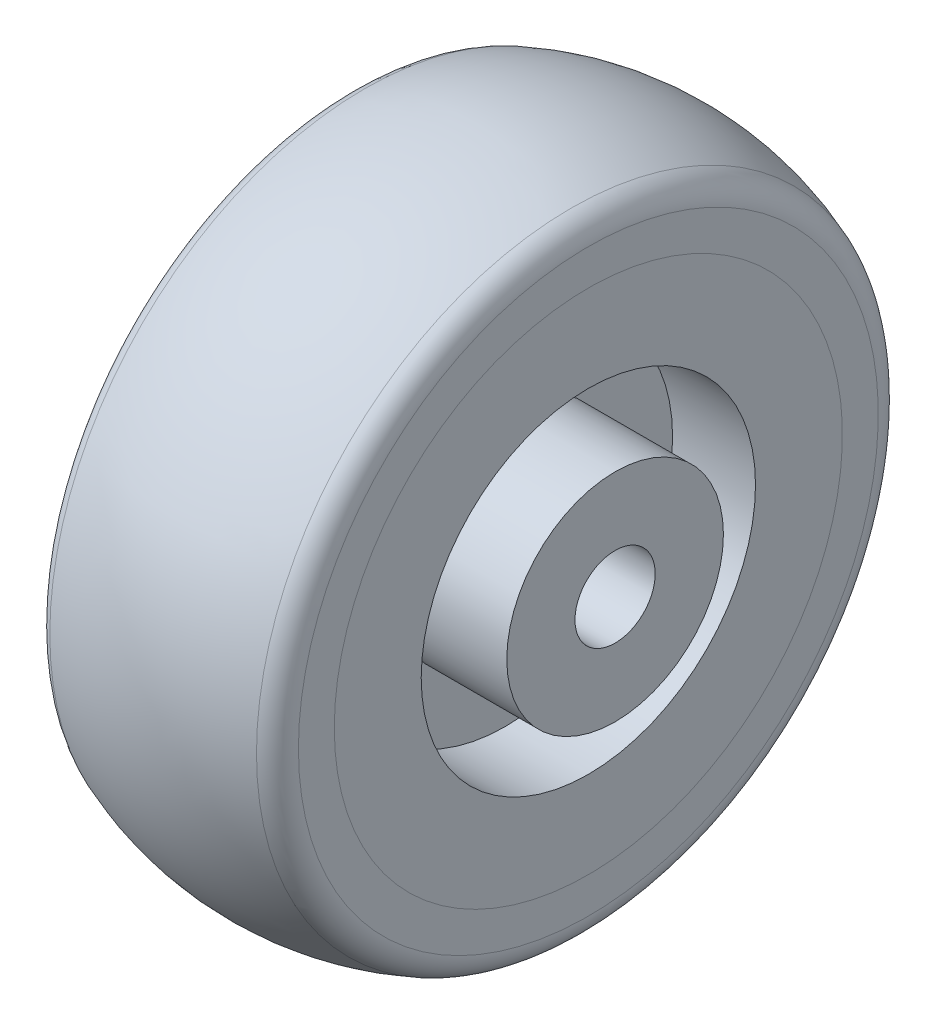
ISO-10303-21;
HEADER;
FILE_DESCRIPTION(('STEP AP214'),'2;1');
FILE_NAME('part.step','',(''),(''),'','','');
FILE_SCHEMA(('AUTOMOTIVE_DESIGN { 1 0 10303 214 1 1 1 1 }'));
ENDSEC;
DATA;
#1=APPLICATION_CONTEXT('core data for automotive mechanical design processes');
#2=APPLICATION_PROTOCOL_DEFINITION('international standard','automotive_design',2000,#1);
#3=PRODUCT_CONTEXT('',#1,'mechanical');
#4=PRODUCT('Part','Part','',(#3));
#5=PRODUCT_RELATED_PRODUCT_CATEGORY('part','',(#4));
#6=PRODUCT_DEFINITION_FORMATION('','',#4);
#7=PRODUCT_DEFINITION_CONTEXT('part definition',#1,'design');
#8=PRODUCT_DEFINITION('design','',#6,#7);
#9=PRODUCT_DEFINITION_SHAPE('','',#8);
#10=(LENGTH_UNIT() NAMED_UNIT(*) SI_UNIT(.MILLI.,.METRE.));
#11=(NAMED_UNIT(*) PLANE_ANGLE_UNIT() SI_UNIT($,.RADIAN.));
#12=(NAMED_UNIT(*) SI_UNIT($,.STERADIAN.) SOLID_ANGLE_UNIT());
#13=UNCERTAINTY_MEASURE_WITH_UNIT(LENGTH_MEASURE(1.E-05),#10,'distance_accuracy_value','');
#14=(GEOMETRIC_REPRESENTATION_CONTEXT(3) GLOBAL_UNCERTAINTY_ASSIGNED_CONTEXT((#13)) GLOBAL_UNIT_ASSIGNED_CONTEXT((#10,
#11,#12)) REPRESENTATION_CONTEXT('',''));
#15=CARTESIAN_POINT('',(0.,0.,0.));
#16=DIRECTION('',(0.,0.,1.));
#17=DIRECTION('',(1.,0.,0.));
#18=AXIS2_PLACEMENT_3D('',#15,#16,#17);
#19=CARTESIAN_POINT('',(-9.,12.5,0.));
#20=DIRECTION('',(1.,0.,0.));
#21=DIRECTION('',(0.,0.,-1.));
#22=AXIS2_PLACEMENT_3D('',#19,#20,#21);
#23=PLANE('',#22);
#24=CARTESIAN_POINT('',(-9.,0.,0.));
#25=DIRECTION('',(-1.,0.,0.));
#26=DIRECTION('',(0.,0.,1.));
#27=AXIS2_PLACEMENT_3D('',#24,#25,#26);
#28=CIRCLE('',#27,21.6821638404293);
#29=CARTESIAN_POINT('',(-9.,0.,21.6821638404293));
#30=VERTEX_POINT('',#29);
#31=EDGE_CURVE('E78',#30,#30,#28,.T.);
#32=ORIENTED_EDGE('',*,*,#31,.T.);
#33=EDGE_LOOP('',(#32));
#34=FACE_BOUND('',#33,.T.);
#35=CARTESIAN_POINT('',(-9.,0.,0.));
#36=DIRECTION('',(1.,0.,0.));
#37=DIRECTION('',(0.,0.,-1.));
#38=AXIS2_PLACEMENT_3D('',#35,#36,#37);
#39=CIRCLE('',#38,19.);
#40=CARTESIAN_POINT('',(-9.,0.,-19.));
#41=VERTEX_POINT('',#40);
#42=EDGE_CURVE('E10',#41,#41,#39,.F.);
#43=ORIENTED_EDGE('',*,*,#42,.F.);
#44=EDGE_LOOP('',(#43));
#45=FACE_BOUND('',#44,.T.);
#46=ADVANCED_FACE('F35',(#34,#45),#23,.F.);
#47=CARTESIAN_POINT('',(9.,12.5,0.));
#48=DIRECTION('',(-1.,0.,0.));
#49=DIRECTION('',(0.,0.,1.));
#50=AXIS2_PLACEMENT_3D('',#47,#48,#49);
#51=PLANE('',#50);
#52=CARTESIAN_POINT('',(9.,0.,0.));
#53=DIRECTION('',(-1.,0.,0.));
#54=DIRECTION('',(0.,0.,1.));
#55=AXIS2_PLACEMENT_3D('',#52,#53,#54);
#56=CIRCLE('',#55,21.6821638404293);
#57=CARTESIAN_POINT('',(9.,0.,21.6821638404293));
#58=VERTEX_POINT('',#57);
#59=EDGE_CURVE('E69',#58,#58,#56,.T.);
#60=ORIENTED_EDGE('',*,*,#59,.F.);
#61=EDGE_LOOP('',(#60));
#62=FACE_BOUND('',#61,.T.);
#63=CARTESIAN_POINT('',(9.,0.,0.));
#64=DIRECTION('',(-1.,0.,0.));
#65=DIRECTION('',(0.,0.,1.));
#66=AXIS2_PLACEMENT_3D('',#63,#64,#65);
#67=CIRCLE('',#66,19.);
#68=CARTESIAN_POINT('',(9.,0.,19.));
#69=VERTEX_POINT('',#68);
#70=EDGE_CURVE('E39',#69,#69,#67,.F.);
#71=ORIENTED_EDGE('',*,*,#70,.F.);
#72=EDGE_LOOP('',(#71));
#73=FACE_BOUND('',#72,.T.);
#74=ADVANCED_FACE('F124',(#62,#73),#51,.F.);
#75=CARTESIAN_POINT('',(-11.,8.1,0.));
#76=DIRECTION('',(1.,0.,0.));
#77=DIRECTION('',(0.,0.,-1.));
#78=AXIS2_PLACEMENT_3D('',#75,#76,#77);
#79=PLANE('',#78);
#80=CARTESIAN_POINT('',(-11.,0.,0.));
#81=DIRECTION('',(-1.,0.,0.));
#82=DIRECTION('',(0.,0.,1.));
#83=AXIS2_PLACEMENT_3D('',#80,#81,#82);
#84=CIRCLE('',#83,3.);
#85=CARTESIAN_POINT('',(-11.,0.,3.));
#86=VERTEX_POINT('',#85);
#87=EDGE_CURVE('E50',#86,#86,#84,.T.);
#88=ORIENTED_EDGE('',*,*,#87,.F.);
#89=EDGE_LOOP('',(#88));
#90=FACE_BOUND('',#89,.T.);
#91=CARTESIAN_POINT('',(-11.,0.,0.));
#92=DIRECTION('',(-1.,0.,0.));
#93=DIRECTION('',(0.,0.,1.));
#94=AXIS2_PLACEMENT_3D('',#91,#92,#93);
#95=CIRCLE('',#94,8.1);
#96=CARTESIAN_POINT('',(-11.,0.,8.1));
#97=VERTEX_POINT('',#96);
#98=EDGE_CURVE('E90',#97,#97,#95,.T.);
#99=ORIENTED_EDGE('',*,*,#98,.T.);
#100=EDGE_LOOP('',(#99));
#101=FACE_BOUND('',#100,.T.);
#102=ADVANCED_FACE('F37',(#90,#101),#79,.F.);
#103=CARTESIAN_POINT('',(-11.,0.,0.));
#104=DIRECTION('',(-1.,0.,0.));
#105=DIRECTION('',(0.,0.,1.));
#106=AXIS2_PLACEMENT_3D('',#103,#104,#105);
#107=CYLINDRICAL_SURFACE('',#106,3.);
#108=CARTESIAN_POINT('',(11.,0.,0.));
#109=DIRECTION('',(-1.,0.,0.));
#110=DIRECTION('',(0.,0.,1.));
#111=AXIS2_PLACEMENT_3D('',#108,#109,#110);
#112=CIRCLE('',#111,3.);
#113=CARTESIAN_POINT('',(11.,0.,3.));
#114=VERTEX_POINT('',#113);
#115=EDGE_CURVE('E54',#114,#114,#112,.T.);
#116=ORIENTED_EDGE('',*,*,#115,.F.);
#117=EDGE_LOOP('',(#116));
#118=FACE_BOUND('',#117,.T.);
#119=ORIENTED_EDGE('',*,*,#87,.T.);
#120=EDGE_LOOP('',(#119));
#121=FACE_BOUND('',#120,.T.);
#122=ADVANCED_FACE('F175',(#118,#121),#107,.F.);
#123=CARTESIAN_POINT('',(11.,3.,0.));
#124=DIRECTION('',(-1.,0.,0.));
#125=DIRECTION('',(0.,0.,1.));
#126=AXIS2_PLACEMENT_3D('',#123,#124,#125);
#127=PLANE('',#126);
#128=CARTESIAN_POINT('',(11.,0.,0.));
#129=DIRECTION('',(-1.,0.,0.));
#130=DIRECTION('',(0.,0.,1.));
#131=AXIS2_PLACEMENT_3D('',#128,#129,#130);
#132=CIRCLE('',#131,8.1);
#133=CARTESIAN_POINT('',(11.,0.,8.1));
#134=VERTEX_POINT('',#133);
#135=EDGE_CURVE('E57',#134,#134,#132,.T.);
#136=ORIENTED_EDGE('',*,*,#135,.F.);
#137=EDGE_LOOP('',(#136));
#138=FACE_BOUND('',#137,.T.);
#139=ORIENTED_EDGE('',*,*,#115,.T.);
#140=EDGE_LOOP('',(#139));
#141=FACE_BOUND('',#140,.T.);
#142=ADVANCED_FACE('F169',(#138,#141),#127,.F.);
#143=CARTESIAN_POINT('',(-11.,0.,0.));
#144=DIRECTION('',(-1.,0.,0.));
#145=DIRECTION('',(0.,0.,1.));
#146=AXIS2_PLACEMENT_3D('',#143,#144,#145);
#147=CYLINDRICAL_SURFACE('',#146,8.1);
#148=CARTESIAN_POINT('',(2.8,0.,0.));
#149=DIRECTION('',(-1.,0.,0.));
#150=DIRECTION('',(0.,0.,1.));
#151=AXIS2_PLACEMENT_3D('',#148,#149,#150);
#152=CIRCLE('',#151,8.1);
#153=CARTESIAN_POINT('',(2.8,0.,8.1));
#154=VERTEX_POINT('',#153);
#155=EDGE_CURVE('E60',#154,#154,#152,.T.);
#156=ORIENTED_EDGE('',*,*,#155,.F.);
#157=EDGE_LOOP('',(#156));
#158=FACE_BOUND('',#157,.T.);
#159=ORIENTED_EDGE('',*,*,#135,.T.);
#160=EDGE_LOOP('',(#159));
#161=FACE_BOUND('',#160,.T.);
#162=ADVANCED_FACE('F163',(#158,#161),#147,.T.);
#163=CARTESIAN_POINT('',(2.8,8.1,0.));
#164=DIRECTION('',(-1.,0.,0.));
#165=DIRECTION('',(0.,0.,1.));
#166=AXIS2_PLACEMENT_3D('',#163,#164,#165);
#167=PLANE('',#166);
#168=CARTESIAN_POINT('',(2.8,0.,0.));
#169=DIRECTION('',(-1.,0.,0.));
#170=DIRECTION('',(0.,0.,1.));
#171=AXIS2_PLACEMENT_3D('',#168,#169,#170);
#172=CIRCLE('',#171,12.5);
#173=CARTESIAN_POINT('',(2.8,0.,12.5));
#174=VERTEX_POINT('',#173);
#175=EDGE_CURVE('E63',#174,#174,#172,.T.);
#176=ORIENTED_EDGE('',*,*,#175,.F.);
#177=EDGE_LOOP('',(#176));
#178=FACE_BOUND('',#177,.T.);
#179=ORIENTED_EDGE('',*,*,#155,.T.);
#180=EDGE_LOOP('',(#179));
#181=FACE_BOUND('',#180,.T.);
#182=ADVANCED_FACE('F157',(#178,#181),#167,.F.);
#183=CARTESIAN_POINT('',(-11.,0.,0.));
#184=DIRECTION('',(-1.,0.,0.));
#185=DIRECTION('',(0.,0.,1.));
#186=AXIS2_PLACEMENT_3D('',#183,#184,#185);
#187=CYLINDRICAL_SURFACE('',#186,12.5);
#188=CARTESIAN_POINT('',(9.00000000000001,0.,0.));
#189=DIRECTION('',(-1.,0.,0.));
#190=DIRECTION('',(0.,0.,1.));
#191=AXIS2_PLACEMENT_3D('',#188,#189,#190);
#192=CIRCLE('',#191,12.5);
#193=CARTESIAN_POINT('',(9.00000000000001,0.,12.5));
#194=VERTEX_POINT('',#193);
#195=EDGE_CURVE('E66',#194,#194,#192,.T.);
#196=ORIENTED_EDGE('',*,*,#195,.F.);
#197=EDGE_LOOP('',(#196));
#198=FACE_BOUND('',#197,.T.);
#199=ORIENTED_EDGE('',*,*,#175,.T.);
#200=EDGE_LOOP('',(#199));
#201=FACE_BOUND('',#200,.T.);
#202=ADVANCED_FACE('F152',(#198,#201),#187,.F.);
#203=ORIENTED_EDGE('',*,*,#70,.T.);
#204=EDGE_LOOP('',(#203));
#205=FACE_BOUND('',#204,.T.);
#206=ORIENTED_EDGE('',*,*,#195,.T.);
#207=EDGE_LOOP('',(#206));
#208=FACE_BOUND('',#207,.T.);
#209=ADVANCED_FACE('F131',(#205,#208),#51,.F.);
#210=CARTESIAN_POINT('',(7.,0.,0.));
#211=DIRECTION('',(-1.,0.,0.));
#212=DIRECTION('',(0.,0.,1.));
#213=AXIS2_PLACEMENT_3D('',#210,#211,#212);
#214=TOROIDAL_SURFACE('',#213,21.6821638404293,2.);
#215=CARTESIAN_POINT('',(7.72727272727273,0.,0.));
#216=DIRECTION('',(-1.,0.,0.));
#217=DIRECTION('',(0.,0.,1.));
#218=AXIS2_PLACEMENT_3D('',#215,#216,#217);
#219=CIRCLE('',#218,23.5452457978765);
#220=CARTESIAN_POINT('',(7.72727272727273,0.,23.5452457978765));
#221=VERTEX_POINT('',#220);
#222=EDGE_CURVE('E72',#221,#221,#219,.T.);
#223=ORIENTED_EDGE('',*,*,#222,.F.);
#224=EDGE_LOOP('',(#223));
#225=FACE_BOUND('',#224,.T.);
#226=ORIENTED_EDGE('',*,*,#59,.T.);
#227=EDGE_LOOP('',(#226));
#228=FACE_BOUND('',#227,.T.);
#229=ADVANCED_FACE('F139',(#225,#228),#214,.T.);
#230=CARTESIAN_POINT('',(0.,0.,0.));
#231=DIRECTION('',(-1.,0.,0.));
#232=DIRECTION('',(0.,0.,1.));
#233=AXIS2_PLACEMENT_3D('',#230,#231,#232);
#234=DEGENERATE_TOROIDAL_SURFACE('',#233,3.75000000000006,21.2499999999999,.T.);
#235=CARTESIAN_POINT('',(-7.72727272727273,0.,0.));
#236=DIRECTION('',(-1.,0.,0.));
#237=DIRECTION('',(0.,0.,1.));
#238=AXIS2_PLACEMENT_3D('',#235,#236,#237);
#239=CIRCLE('',#238,23.5452457978765);
#240=CARTESIAN_POINT('',(-7.72727272727273,0.,23.5452457978765));
#241=VERTEX_POINT('',#240);
#242=EDGE_CURVE('E75',#241,#241,#239,.T.);
#243=ORIENTED_EDGE('',*,*,#242,.F.);
#244=EDGE_LOOP('',(#243));
#245=FACE_BOUND('',#244,.T.);
#246=ORIENTED_EDGE('',*,*,#222,.T.);
#247=EDGE_LOOP('',(#246));
#248=FACE_BOUND('',#247,.T.);
#249=ADVANCED_FACE('F120',(#245,#248),#234,.T.);
#250=CARTESIAN_POINT('',(-7.,0.,0.));
#251=DIRECTION('',(-1.,0.,0.));
#252=DIRECTION('',(0.,0.,1.));
#253=AXIS2_PLACEMENT_3D('',#250,#251,#252);
#254=TOROIDAL_SURFACE('',#253,21.6821638404293,2.);
#255=ORIENTED_EDGE('',*,*,#31,.F.);
#256=EDGE_LOOP('',(#255));
#257=FACE_BOUND('',#256,.T.);
#258=ORIENTED_EDGE('',*,*,#242,.T.);
#259=EDGE_LOOP('',(#258));
#260=FACE_BOUND('',#259,.T.);
#261=ADVANCED_FACE('F115',(#257,#260),#254,.T.);
#262=ORIENTED_EDGE('',*,*,#42,.T.);
#263=EDGE_LOOP('',(#262));
#264=FACE_BOUND('',#263,.T.);
#265=CARTESIAN_POINT('',(-9.,0.,0.));
#266=DIRECTION('',(-1.,0.,0.));
#267=DIRECTION('',(0.,0.,1.));
#268=AXIS2_PLACEMENT_3D('',#265,#266,#267);
#269=CIRCLE('',#268,12.5);
#270=CARTESIAN_POINT('',(-9.,0.,12.5));
#271=VERTEX_POINT('',#270);
#272=EDGE_CURVE('E81',#271,#271,#269,.T.);
#273=ORIENTED_EDGE('',*,*,#272,.F.);
#274=EDGE_LOOP('',(#273));
#275=FACE_BOUND('',#274,.T.);
#276=ADVANCED_FACE('F110',(#264,#275),#23,.F.);
#277=CARTESIAN_POINT('',(-11.,0.,0.));
#278=DIRECTION('',(-1.,0.,0.));
#279=DIRECTION('',(0.,0.,1.));
#280=AXIS2_PLACEMENT_3D('',#277,#278,#279);
#281=CYLINDRICAL_SURFACE('',#280,12.5);
#282=CARTESIAN_POINT('',(-2.8,0.,0.));
#283=DIRECTION('',(-1.,0.,0.));
#284=DIRECTION('',(0.,0.,1.));
#285=AXIS2_PLACEMENT_3D('',#282,#283,#284);
#286=CIRCLE('',#285,12.5);
#287=CARTESIAN_POINT('',(-2.8,0.,12.5));
#288=VERTEX_POINT('',#287);
#289=EDGE_CURVE('E84',#288,#288,#286,.T.);
#290=ORIENTED_EDGE('',*,*,#289,.F.);
#291=EDGE_LOOP('',(#290));
#292=FACE_BOUND('',#291,.T.);
#293=ORIENTED_EDGE('',*,*,#272,.T.);
#294=EDGE_LOOP('',(#293));
#295=FACE_BOUND('',#294,.T.);
#296=ADVANCED_FACE('F104',(#292,#295),#281,.F.);
#297=CARTESIAN_POINT('',(-2.8,12.5,0.));
#298=DIRECTION('',(1.,0.,0.));
#299=DIRECTION('',(0.,0.,-1.));
#300=AXIS2_PLACEMENT_3D('',#297,#298,#299);
#301=PLANE('',#300);
#302=CARTESIAN_POINT('',(-2.8,0.,0.));
#303=DIRECTION('',(-1.,0.,0.));
#304=DIRECTION('',(0.,0.,1.));
#305=AXIS2_PLACEMENT_3D('',#302,#303,#304);
#306=CIRCLE('',#305,8.1);
#307=CARTESIAN_POINT('',(-2.8,0.,8.1));
#308=VERTEX_POINT('',#307);
#309=EDGE_CURVE('E87',#308,#308,#306,.T.);
#310=ORIENTED_EDGE('',*,*,#309,.F.);
#311=EDGE_LOOP('',(#310));
#312=FACE_BOUND('',#311,.T.);
#313=ORIENTED_EDGE('',*,*,#289,.T.);
#314=EDGE_LOOP('',(#313));
#315=FACE_BOUND('',#314,.T.);
#316=ADVANCED_FACE('F98',(#312,#315),#301,.F.);
#317=CARTESIAN_POINT('',(-11.,0.,0.));
#318=DIRECTION('',(-1.,0.,0.));
#319=DIRECTION('',(0.,0.,1.));
#320=AXIS2_PLACEMENT_3D('',#317,#318,#319);
#321=CYLINDRICAL_SURFACE('',#320,8.1);
#322=ORIENTED_EDGE('',*,*,#98,.F.);
#323=EDGE_LOOP('',(#322));
#324=FACE_BOUND('',#323,.T.);
#325=ORIENTED_EDGE('',*,*,#309,.T.);
#326=EDGE_LOOP('',(#325));
#327=FACE_BOUND('',#326,.T.);
#328=ADVANCED_FACE('F95',(#324,#327),#321,.T.);
#329=CLOSED_SHELL('',(#46,#74,#102,#122,#142,#162,#182,#202,#209,#229,#249,#261,#276,#296,#316,#328));
#330=MANIFOLD_SOLID_BREP('B2',#329);
#331=ADVANCED_BREP_SHAPE_REPRESENTATION('',(#18,#330),#14);
#332=SHAPE_DEFINITION_REPRESENTATION(#9,#331);
ENDSEC;
END-ISO-10303-21;
